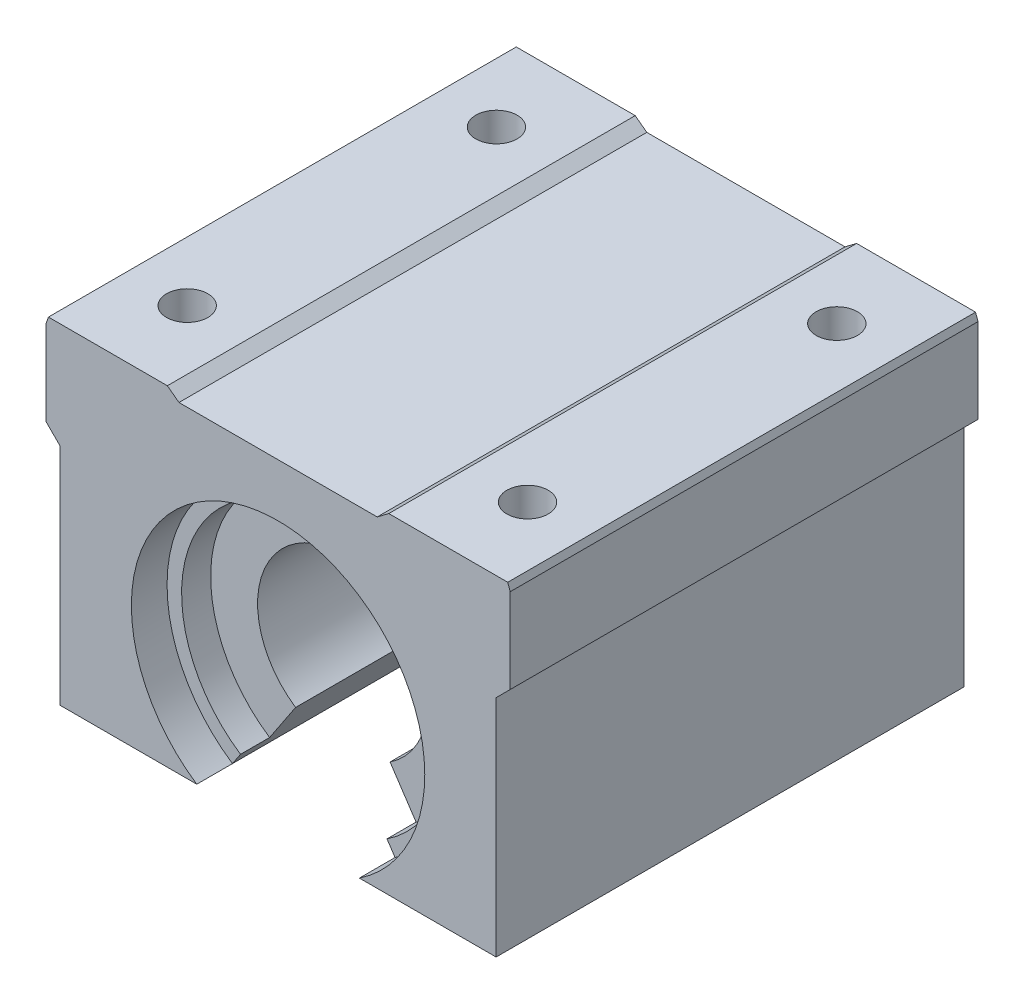
ISO-10303-21;
HEADER;
FILE_DESCRIPTION(('STEP AP214'),'2;1');
FILE_NAME('part.step','',(''),(''),'','','');
FILE_SCHEMA(('AUTOMOTIVE_DESIGN { 1 0 10303 214 1 1 1 1 }'));
ENDSEC;
DATA;
#1=APPLICATION_CONTEXT('core data for automotive mechanical design processes');
#2=APPLICATION_PROTOCOL_DEFINITION('international standard','automotive_design',2000,#1);
#3=PRODUCT_CONTEXT('',#1,'mechanical');
#4=PRODUCT('Part','Part','',(#3));
#5=PRODUCT_RELATED_PRODUCT_CATEGORY('part','',(#4));
#6=PRODUCT_DEFINITION_FORMATION('','',#4);
#7=PRODUCT_DEFINITION_CONTEXT('part definition',#1,'design');
#8=PRODUCT_DEFINITION('design','',#6,#7);
#9=PRODUCT_DEFINITION_SHAPE('','',#8);
#10=(LENGTH_UNIT() NAMED_UNIT(*) SI_UNIT(.MILLI.,.METRE.));
#11=(NAMED_UNIT(*) PLANE_ANGLE_UNIT() SI_UNIT($,.RADIAN.));
#12=(NAMED_UNIT(*) SI_UNIT($,.STERADIAN.) SOLID_ANGLE_UNIT());
#13=UNCERTAINTY_MEASURE_WITH_UNIT(LENGTH_MEASURE(1.E-05),#10,'distance_accuracy_value','');
#14=(GEOMETRIC_REPRESENTATION_CONTEXT(3) GLOBAL_UNCERTAINTY_ASSIGNED_CONTEXT((#13)) GLOBAL_UNIT_ASSIGNED_CONTEXT((#10,
#11,#12)) REPRESENTATION_CONTEXT('',''));
#15=CARTESIAN_POINT('',(0.,0.,0.));
#16=DIRECTION('',(0.,0.,1.));
#17=DIRECTION('',(1.,0.,0.));
#18=AXIS2_PLACEMENT_3D('',#15,#16,#17);
#19=CARTESIAN_POINT('',(0.,-3.72110000000001,19.05));
#20=DIRECTION('',(0.,0.,-1.));
#21=DIRECTION('',(-1.,0.,0.));
#22=AXIS2_PLACEMENT_3D('',#19,#20,#21);
#23=CYLINDRICAL_SURFACE('',#22,12.7);
#24=CARTESIAN_POINT('',(0.,-3.72110000000001,-16.256));
#25=DIRECTION('',(0.,0.,1.));
#26=DIRECTION('',(1.,0.,0.));
#27=AXIS2_PLACEMENT_3D('',#24,#25,#26);
#28=CIRCLE('',#27,12.7);
#29=CARTESIAN_POINT('',(7.03740732273973,-14.2929918918919,-16.256));
#30=VERTEX_POINT('',#29);
#31=CARTESIAN_POINT('',(-7.03740732273972,-14.2929918918919,-16.256));
#32=VERTEX_POINT('',#31);
#33=EDGE_CURVE('E51',#30,#32,#28,.T.);
#34=ORIENTED_EDGE('',*,*,#33,.T.);
#35=DIRECTION('',(0.,0.,-1.));
#36=VECTOR('',#35,1.);
#37=CARTESIAN_POINT('',(-7.03740732273972,-14.2929918918919,19.05));
#38=LINE('',#37,#36);
#39=CARTESIAN_POINT('',(-7.03740732273972,-14.2929918918919,-19.05));
#40=VERTEX_POINT('',#39);
#41=EDGE_CURVE('E225',#32,#40,#38,.T.);
#42=ORIENTED_EDGE('',*,*,#41,.T.);
#43=CARTESIAN_POINT('',(0.,-3.72110000000001,-19.05));
#44=DIRECTION('',(0.,0.,-1.));
#45=DIRECTION('',(1.,0.,0.));
#46=AXIS2_PLACEMENT_3D('',#43,#44,#45);
#47=CIRCLE('',#46,12.7);
#48=CARTESIAN_POINT('',(7.03740732273973,-14.2929918918919,-19.05));
#49=VERTEX_POINT('',#48);
#50=EDGE_CURVE('E443',#40,#49,#47,.T.);
#51=ORIENTED_EDGE('',*,*,#50,.T.);
#52=DIRECTION('',(0.,0.,-1.));
#53=VECTOR('',#52,1.);
#54=CARTESIAN_POINT('',(7.03740732273973,-14.2929918918919,19.05));
#55=LINE('',#54,#53);
#56=EDGE_CURVE('E464',#30,#49,#55,.T.);
#57=ORIENTED_EDGE('',*,*,#56,.F.);
#58=EDGE_LOOP('',(#34,#42,#51,#57));
#59=FACE_BOUND('',#58,.T.);
#60=ADVANCED_FACE('F36',(#59),#23,.F.);
#61=CARTESIAN_POINT('',(0.,-3.72110000000001,-22.479));
#62=DIRECTION('',(0.,0.,1.));
#63=DIRECTION('',(1.,0.,0.));
#64=AXIS2_PLACEMENT_3D('',#61,#62,#63);
#65=CYLINDRICAL_SURFACE('',#64,14.097);
#66=CARTESIAN_POINT('',(0.,-3.72110000000001,-19.05));
#67=DIRECTION('',(0.,0.,1.));
#68=DIRECTION('',(1.,0.,0.));
#69=AXIS2_PLACEMENT_3D('',#66,#67,#68);
#70=CIRCLE('',#69,14.097);
#71=CARTESIAN_POINT('',(7.8115221282411,-15.4559,-19.05));
#72=VERTEX_POINT('',#71);
#73=CARTESIAN_POINT('',(-7.81152212824109,-15.4559,-19.05));
#74=VERTEX_POINT('',#73);
#75=EDGE_CURVE('E433',#72,#74,#70,.T.);
#76=ORIENTED_EDGE('',*,*,#75,.T.);
#77=DIRECTION('',(0.,0.,1.));
#78=VECTOR('',#77,1.);
#79=CARTESIAN_POINT('',(-7.81152212824109,-15.4559,-22.479));
#80=LINE('',#79,#78);
#81=CARTESIAN_POINT('',(-7.8115221282411,-15.4559,-22.479));
#82=VERTEX_POINT('',#81);
#83=EDGE_CURVE('E239',#82,#74,#80,.T.);
#84=ORIENTED_EDGE('',*,*,#83,.F.);
#85=CARTESIAN_POINT('',(0.,-3.72110000000001,-22.479));
#86=DIRECTION('',(0.,0.,1.));
#87=DIRECTION('',(1.,0.,0.));
#88=AXIS2_PLACEMENT_3D('',#85,#86,#87);
#89=CIRCLE('',#88,14.097);
#90=CARTESIAN_POINT('',(7.8115221282411,-15.4559,-22.479));
#91=VERTEX_POINT('',#90);
#92=EDGE_CURVE('E11',#91,#82,#89,.T.);
#93=ORIENTED_EDGE('',*,*,#92,.F.);
#94=DIRECTION('',(0.,0.,1.));
#95=VECTOR('',#94,1.);
#96=CARTESIAN_POINT('',(7.81152212824109,-15.4559,-22.479));
#97=LINE('',#96,#95);
#98=EDGE_CURVE('E235',#72,#91,#97,.F.);
#99=ORIENTED_EDGE('',*,*,#98,.F.);
#100=EDGE_LOOP('',(#76,#84,#93,#99));
#101=FACE_BOUND('',#100,.T.);
#102=ADVANCED_FACE('F431',(#101),#65,.F.);
#103=CARTESIAN_POINT('',(-20.955,-15.4559,22.479));
#104=DIRECTION('',(0.,1.,0.));
#105=DIRECTION('',(0.,0.,1.));
#106=AXIS2_PLACEMENT_3D('',#103,#104,#105);
#107=PLANE('',#106);
#108=CARTESIAN_POINT('',(-16.3533929802272,-15.4559,14.859));
#109=DIRECTION('',(0.,1.,0.));
#110=DIRECTION('',(0.,0.,1.));
#111=AXIS2_PLACEMENT_3D('',#108,#109,#110);
#112=CIRCLE('',#111,1.98437499999999);
#113=CARTESIAN_POINT('',(-16.3533929802272,-15.4559,16.843375));
#114=VERTEX_POINT('',#113);
#115=EDGE_CURVE('E251',#114,#114,#112,.T.);
#116=ORIENTED_EDGE('',*,*,#115,.T.);
#117=EDGE_LOOP('',(#116));
#118=FACE_BOUND('',#117,.T.);
#119=CARTESIAN_POINT('',(-16.3533929802272,-15.4559,-14.859));
#120=DIRECTION('',(0.,1.,0.));
#121=DIRECTION('',(0.,0.,1.));
#122=AXIS2_PLACEMENT_3D('',#119,#120,#121);
#123=CIRCLE('',#122,1.98437499999999);
#124=CARTESIAN_POINT('',(-16.3533929802272,-15.4559,-12.874625));
#125=VERTEX_POINT('',#124);
#126=EDGE_CURVE('E245',#125,#125,#123,.T.);
#127=ORIENTED_EDGE('',*,*,#126,.T.);
#128=EDGE_LOOP('',(#127));
#129=FACE_BOUND('',#128,.T.);
#130=DIRECTION('',(1.,0.,0.));
#131=VECTOR('',#130,1.);
#132=CARTESIAN_POINT('',(-20.955,-15.4559,-22.479));
#133=LINE('',#132,#131);
#134=CARTESIAN_POINT('',(-20.955,-15.4559,-22.479));
#135=VERTEX_POINT('',#134);
#136=EDGE_CURVE('E317',#135,#82,#133,.T.);
#137=ORIENTED_EDGE('',*,*,#136,.T.);
#138=ORIENTED_EDGE('',*,*,#83,.T.);
#139=DIRECTION('',(0.,0.,-1.));
#140=VECTOR('',#139,1.);
#141=CARTESIAN_POINT('',(-7.8115221282411,-15.4559,19.05));
#142=LINE('',#141,#140);
#143=CARTESIAN_POINT('',(-7.81152212824109,-15.4559,19.05));
#144=VERTEX_POINT('',#143);
#145=EDGE_CURVE('E224',#144,#74,#142,.T.);
#146=ORIENTED_EDGE('',*,*,#145,.F.);
#147=CARTESIAN_POINT('',(-7.8115221282411,-15.4559,22.479));
#148=VERTEX_POINT('',#147);
#149=EDGE_CURVE('E59',#144,#148,#80,.T.);
#150=ORIENTED_EDGE('',*,*,#149,.T.);
#151=DIRECTION('',(1.,0.,0.));
#152=VECTOR('',#151,1.);
#153=CARTESIAN_POINT('',(-20.955,-15.4559,22.479));
#154=LINE('',#153,#152);
#155=CARTESIAN_POINT('',(-20.955,-15.4559,22.479));
#156=VERTEX_POINT('',#155);
#157=EDGE_CURVE('E286',#156,#148,#154,.T.);
#158=ORIENTED_EDGE('',*,*,#157,.F.);
#159=DIRECTION('',(0.,0.,-1.));
#160=VECTOR('',#159,1.);
#161=CARTESIAN_POINT('',(-20.955,-15.4559,22.479));
#162=LINE('',#161,#160);
#163=EDGE_CURVE('E346',#156,#135,#162,.T.);
#164=ORIENTED_EDGE('',*,*,#163,.T.);
#165=EDGE_LOOP('',(#137,#138,#146,#150,#158,#164));
#166=FACE_BOUND('',#165,.T.);
#167=ADVANCED_FACE('F436',(#118,#129,#166),#107,.F.);
#168=CARTESIAN_POINT('',(-10.6383929802272,16.2941,22.479));
#169=DIRECTION('',(0.,-1.,0.));
#170=DIRECTION('',(1.,0.,0.));
#171=AXIS2_PLACEMENT_3D('',#168,#169,#170);
#172=PLANE('',#171);
#173=DIRECTION('',(-1.,0.,0.));
#174=VECTOR('',#173,1.);
#175=CARTESIAN_POINT('',(-10.6383929802272,16.2941,-22.479));
#176=LINE('',#175,#174);
#177=CARTESIAN_POINT('',(-10.6383929802272,16.2941,-22.479));
#178=VERTEX_POINT('',#177);
#179=CARTESIAN_POINT('',(-22.0683929802272,16.2941,-22.479));
#180=VERTEX_POINT('',#179);
#181=EDGE_CURVE('E306',#178,#180,#176,.T.);
#182=ORIENTED_EDGE('',*,*,#181,.T.);
#183=DIRECTION('',(0.,0.,-1.));
#184=VECTOR('',#183,1.);
#185=CARTESIAN_POINT('',(-22.0683929802272,16.2941,22.479));
#186=LINE('',#185,#184);
#187=CARTESIAN_POINT('',(-22.0683929802272,16.2941,22.479));
#188=VERTEX_POINT('',#187);
#189=EDGE_CURVE('E358',#188,#180,#186,.T.);
#190=ORIENTED_EDGE('',*,*,#189,.F.);
#191=DIRECTION('',(-1.,0.,0.));
#192=VECTOR('',#191,1.);
#193=CARTESIAN_POINT('',(-10.6383929802272,16.2941,22.479));
#194=LINE('',#193,#192);
#195=CARTESIAN_POINT('',(-10.6383929802272,16.2941,22.479));
#196=VERTEX_POINT('',#195);
#197=EDGE_CURVE('E275',#196,#188,#194,.T.);
#198=ORIENTED_EDGE('',*,*,#197,.F.);
#199=DIRECTION('',(0.,0.,-1.));
#200=VECTOR('',#199,1.);
#201=CARTESIAN_POINT('',(-10.6383929802272,16.2941,22.479));
#202=LINE('',#201,#200);
#203=EDGE_CURVE('E361',#196,#178,#202,.T.);
#204=ORIENTED_EDGE('',*,*,#203,.T.);
#205=EDGE_LOOP('',(#182,#190,#198,#204));
#206=FACE_BOUND('',#205,.T.);
#207=CARTESIAN_POINT('',(-16.3533929802272,16.2941,14.859));
#208=DIRECTION('',(0.,1.,0.));
#209=DIRECTION('',(0.,0.,1.));
#210=AXIS2_PLACEMENT_3D('',#207,#208,#209);
#211=CIRCLE('',#210,1.984375);
#212=CARTESIAN_POINT('',(-16.3533929802272,16.2941,16.843375));
#213=VERTEX_POINT('',#212);
#214=EDGE_CURVE('E248',#213,#213,#211,.T.);
#215=ORIENTED_EDGE('',*,*,#214,.F.);
#216=EDGE_LOOP('',(#215));
#217=FACE_BOUND('',#216,.T.);
#218=CARTESIAN_POINT('',(-16.3533929802272,16.2941,-14.859));
#219=DIRECTION('',(0.,1.,0.));
#220=DIRECTION('',(0.,0.,1.));
#221=AXIS2_PLACEMENT_3D('',#218,#219,#220);
#222=CIRCLE('',#221,1.984375);
#223=CARTESIAN_POINT('',(-16.3533929802272,16.2941,-12.874625));
#224=VERTEX_POINT('',#223);
#225=EDGE_CURVE('E242',#224,#224,#222,.T.);
#226=ORIENTED_EDGE('',*,*,#225,.F.);
#227=EDGE_LOOP('',(#226));
#228=FACE_BOUND('',#227,.T.);
#229=ADVANCED_FACE('F389',(#206,#217,#228),#172,.F.);
#230=CARTESIAN_POINT('',(22.0683929802272,16.2941,22.479));
#231=DIRECTION('',(0.,-1.,0.));
#232=DIRECTION('',(1.,0.,0.));
#233=AXIS2_PLACEMENT_3D('',#230,#231,#232);
#234=PLANE('',#233);
#235=CARTESIAN_POINT('',(16.3533929802273,16.2941,14.859));
#236=DIRECTION('',(0.,1.,0.));
#237=DIRECTION('',(0.,0.,1.));
#238=AXIS2_PLACEMENT_3D('',#235,#236,#237);
#239=CIRCLE('',#238,1.984375);
#240=CARTESIAN_POINT('',(16.3533929802273,16.2941,16.843375));
#241=VERTEX_POINT('',#240);
#242=EDGE_CURVE('E254',#241,#241,#239,.T.);
#243=ORIENTED_EDGE('',*,*,#242,.F.);
#244=EDGE_LOOP('',(#243));
#245=FACE_BOUND('',#244,.T.);
#246=DIRECTION('',(-1.,0.,0.));
#247=VECTOR('',#246,1.);
#248=CARTESIAN_POINT('',(22.0683929802272,16.2941,-22.479));
#249=LINE('',#248,#247);
#250=CARTESIAN_POINT('',(22.0683929802272,16.2941,-22.479));
#251=VERTEX_POINT('',#250);
#252=CARTESIAN_POINT('',(10.6383929802272,16.2941,-22.479));
#253=VERTEX_POINT('',#252);
#254=EDGE_CURVE('E271',#251,#253,#249,.T.);
#255=ORIENTED_EDGE('',*,*,#254,.T.);
#256=DIRECTION('',(0.,0.,-1.));
#257=VECTOR('',#256,1.);
#258=CARTESIAN_POINT('',(10.6383929802272,16.2941,22.479));
#259=LINE('',#258,#257);
#260=CARTESIAN_POINT('',(10.6383929802272,16.2941,22.479));
#261=VERTEX_POINT('',#260);
#262=EDGE_CURVE('E299',#261,#253,#259,.T.);
#263=ORIENTED_EDGE('',*,*,#262,.F.);
#264=DIRECTION('',(-1.,0.,0.));
#265=VECTOR('',#264,1.);
#266=CARTESIAN_POINT('',(22.0683929802272,16.2941,22.479));
#267=LINE('',#266,#265);
#268=CARTESIAN_POINT('',(22.0683929802272,16.2941,22.479));
#269=VERTEX_POINT('',#268);
#270=EDGE_CURVE('E297',#269,#261,#267,.T.);
#271=ORIENTED_EDGE('',*,*,#270,.F.);
#272=DIRECTION('',(0.,0.,-1.));
#273=VECTOR('',#272,1.);
#274=CARTESIAN_POINT('',(22.0683929802272,16.2941,22.479));
#275=LINE('',#274,#273);
#276=EDGE_CURVE('E331',#269,#251,#275,.T.);
#277=ORIENTED_EDGE('',*,*,#276,.T.);
#278=EDGE_LOOP('',(#255,#263,#271,#277));
#279=FACE_BOUND('',#278,.T.);
#280=CARTESIAN_POINT('',(16.3533929802272,16.2941,-14.859));
#281=DIRECTION('',(0.,1.,0.));
#282=DIRECTION('',(0.,0.,1.));
#283=AXIS2_PLACEMENT_3D('',#280,#281,#282);
#284=CIRCLE('',#283,1.984375);
#285=CARTESIAN_POINT('',(16.3533929802272,16.2941,-12.874625));
#286=VERTEX_POINT('',#285);
#287=EDGE_CURVE('E260',#286,#286,#284,.T.);
#288=ORIENTED_EDGE('',*,*,#287,.F.);
#289=EDGE_LOOP('',(#288));
#290=FACE_BOUND('',#289,.T.);
#291=ADVANCED_FACE('F401',(#245,#279,#290),#234,.F.);
#292=CARTESIAN_POINT('',(10.6383929802272,16.2941,22.479));
#293=DIRECTION('',(0.601448008613873,-0.798911943166709,0.));
#294=DIRECTION('',(0.798911943166709,0.601448008613873,0.));
#295=AXIS2_PLACEMENT_3D('',#292,#293,#294);
#296=PLANE('',#295);
#297=DIRECTION('',(-0.798911943166709,-0.601448008613873,0.));
#298=VECTOR('',#297,1.);
#299=CARTESIAN_POINT('',(10.6383929802272,16.2941,-22.479));
#300=LINE('',#299,#298);
#301=CARTESIAN_POINT('',(9.525,15.4559,-22.479));
#302=VERTEX_POINT('',#301);
#303=EDGE_CURVE('E266',#253,#302,#300,.T.);
#304=ORIENTED_EDGE('',*,*,#303,.T.);
#305=DIRECTION('',(0.,0.,-1.));
#306=VECTOR('',#305,1.);
#307=CARTESIAN_POINT('',(9.525,15.4559,22.479));
#308=LINE('',#307,#306);
#309=CARTESIAN_POINT('',(9.525,15.4559,22.479));
#310=VERTEX_POINT('',#309);
#311=EDGE_CURVE('E44',#310,#302,#308,.T.);
#312=ORIENTED_EDGE('',*,*,#311,.F.);
#313=DIRECTION('',(-0.798911943166709,-0.601448008613873,0.));
#314=VECTOR('',#313,1.);
#315=CARTESIAN_POINT('',(10.6383929802272,16.2941,22.479));
#316=LINE('',#315,#314);
#317=EDGE_CURVE('E267',#261,#310,#316,.T.);
#318=ORIENTED_EDGE('',*,*,#317,.F.);
#319=ORIENTED_EDGE('',*,*,#262,.T.);
#320=EDGE_LOOP('',(#304,#312,#318,#319));
#321=FACE_BOUND('',#320,.T.);
#322=ADVANCED_FACE('F38',(#321),#296,.F.);
#323=CARTESIAN_POINT('',(9.525,15.4559,22.479));
#324=DIRECTION('',(0.,-1.,0.));
#325=DIRECTION('',(0.,0.,-1.));
#326=AXIS2_PLACEMENT_3D('',#323,#324,#325);
#327=PLANE('',#326);
#328=DIRECTION('',(-1.,0.,0.));
#329=VECTOR('',#328,1.);
#330=CARTESIAN_POINT('',(9.525,15.4559,-22.479));
#331=LINE('',#330,#329);
#332=CARTESIAN_POINT('',(-9.525,15.4559,-22.479));
#333=VERTEX_POINT('',#332);
#334=EDGE_CURVE('E302',#302,#333,#331,.T.);
#335=ORIENTED_EDGE('',*,*,#334,.T.);
#336=DIRECTION('',(0.,0.,-1.));
#337=VECTOR('',#336,1.);
#338=CARTESIAN_POINT('',(-9.525,15.4559,22.479));
#339=LINE('',#338,#337);
#340=CARTESIAN_POINT('',(-9.525,15.4559,22.479));
#341=VERTEX_POINT('',#340);
#342=EDGE_CURVE('E364',#341,#333,#339,.T.);
#343=ORIENTED_EDGE('',*,*,#342,.F.);
#344=DIRECTION('',(-1.,0.,0.));
#345=VECTOR('',#344,1.);
#346=CARTESIAN_POINT('',(9.525,15.4559,22.479));
#347=LINE('',#346,#345);
#348=EDGE_CURVE('E270',#310,#341,#347,.T.);
#349=ORIENTED_EDGE('',*,*,#348,.F.);
#350=ORIENTED_EDGE('',*,*,#311,.T.);
#351=EDGE_LOOP('',(#335,#343,#349,#350));
#352=FACE_BOUND('',#351,.T.);
#353=ADVANCED_FACE('F369',(#352),#327,.F.);
#354=CARTESIAN_POINT('',(-9.525,15.4559,22.479));
#355=DIRECTION('',(-0.601448008613873,-0.798911943166709,0.));
#356=DIRECTION('',(0.798911943166709,-0.601448008613873,0.));
#357=AXIS2_PLACEMENT_3D('',#354,#355,#356);
#358=PLANE('',#357);
#359=DIRECTION('',(-0.798911943166709,0.601448008613873,0.));
#360=VECTOR('',#359,1.);
#361=CARTESIAN_POINT('',(-9.525,15.4559,-22.479));
#362=LINE('',#361,#360);
#363=EDGE_CURVE('E304',#333,#178,#362,.T.);
#364=ORIENTED_EDGE('',*,*,#363,.T.);
#365=ORIENTED_EDGE('',*,*,#203,.F.);
#366=DIRECTION('',(-0.798911943166709,0.601448008613873,0.));
#367=VECTOR('',#366,1.);
#368=CARTESIAN_POINT('',(-9.525,15.4559,22.479));
#369=LINE('',#368,#367);
#370=EDGE_CURVE('E273',#341,#196,#369,.T.);
#371=ORIENTED_EDGE('',*,*,#370,.F.);
#372=ORIENTED_EDGE('',*,*,#342,.T.);
#373=EDGE_LOOP('',(#364,#365,#371,#372));
#374=FACE_BOUND('',#373,.T.);
#375=ADVANCED_FACE('F385',(#374),#358,.F.);
#376=CARTESIAN_POINT('',(-22.3012,15.6191799227722,22.479));
#377=DIRECTION('',(0.945340188352479,-0.326085768296777,0.));
#378=DIRECTION('',(0.326085768296777,0.945340188352479,0.));
#379=AXIS2_PLACEMENT_3D('',#376,#377,#378);
#380=PLANE('',#379);
#381=DIRECTION('',(-0.326085768296777,-0.945340188352479,0.));
#382=VECTOR('',#381,1.);
#383=CARTESIAN_POINT('',(-22.3012,15.6191799227722,-22.479));
#384=LINE('',#383,#382);
#385=CARTESIAN_POINT('',(-22.3012,15.6191799227722,-22.479));
#386=VERTEX_POINT('',#385);
#387=EDGE_CURVE('E308',#180,#386,#384,.T.);
#388=ORIENTED_EDGE('',*,*,#387,.T.);
#389=DIRECTION('',(0.,0.,-1.));
#390=VECTOR('',#389,1.);
#391=CARTESIAN_POINT('',(-22.3012,15.6191799227722,22.479));
#392=LINE('',#391,#390);
#393=CARTESIAN_POINT('',(-22.3012,15.6191799227722,22.479));
#394=VERTEX_POINT('',#393);
#395=EDGE_CURVE('E355',#394,#386,#392,.T.);
#396=ORIENTED_EDGE('',*,*,#395,.F.);
#397=DIRECTION('',(-0.326085768296777,-0.945340188352479,0.));
#398=VECTOR('',#397,1.);
#399=CARTESIAN_POINT('',(-22.3012,15.6191799227722,22.479));
#400=LINE('',#399,#398);
#401=EDGE_CURVE('E277',#188,#394,#400,.T.);
#402=ORIENTED_EDGE('',*,*,#401,.F.);
#403=ORIENTED_EDGE('',*,*,#189,.T.);
#404=EDGE_LOOP('',(#388,#396,#402,#403));
#405=FACE_BOUND('',#404,.T.);
#406=ADVANCED_FACE('F554',(#405),#380,.F.);
#407=CARTESIAN_POINT('',(-22.3012,15.6191799227722,22.479));
#408=DIRECTION('',(1.,0.,0.));
#409=DIRECTION('',(0.,0.,-1.));
#410=AXIS2_PLACEMENT_3D('',#407,#408,#409);
#411=PLANE('',#410);
#412=DIRECTION('',(0.,-1.,0.));
#413=VECTOR('',#412,1.);
#414=CARTESIAN_POINT('',(-22.3012,15.6191799227722,-22.479));
#415=LINE('',#414,#413);
#416=CARTESIAN_POINT('',(-22.3012,7.4803,-22.479));
#417=VERTEX_POINT('',#416);
#418=EDGE_CURVE('E310',#386,#417,#415,.T.);
#419=ORIENTED_EDGE('',*,*,#418,.T.);
#420=DIRECTION('',(0.,0.,-1.));
#421=VECTOR('',#420,1.);
#422=CARTESIAN_POINT('',(-22.3012,7.4803,22.479));
#423=LINE('',#422,#421);
#424=CARTESIAN_POINT('',(-22.3012,7.4803,22.479));
#425=VERTEX_POINT('',#424);
#426=EDGE_CURVE('E352',#425,#417,#423,.T.);
#427=ORIENTED_EDGE('',*,*,#426,.F.);
#428=DIRECTION('',(0.,-1.,0.));
#429=VECTOR('',#428,1.);
#430=CARTESIAN_POINT('',(-22.3012,15.6191799227722,22.479));
#431=LINE('',#430,#429);
#432=EDGE_CURVE('E279',#394,#425,#431,.T.);
#433=ORIENTED_EDGE('',*,*,#432,.F.);
#434=ORIENTED_EDGE('',*,*,#395,.T.);
#435=EDGE_LOOP('',(#419,#427,#433,#434));
#436=FACE_BOUND('',#435,.T.);
#437=ADVANCED_FACE('F550',(#436),#411,.F.);
#438=CARTESIAN_POINT('',(-22.3012,7.4803,22.479));
#439=DIRECTION('',(0.707106781186547,0.707106781186548,0.));
#440=DIRECTION('',(-0.707106781186548,0.707106781186547,0.));
#441=AXIS2_PLACEMENT_3D('',#438,#439,#440);
#442=PLANE('',#441);
#443=DIRECTION('',(0.707106781186548,-0.707106781186547,0.));
#444=VECTOR('',#443,1.);
#445=CARTESIAN_POINT('',(-22.3012,7.4803,-22.479));
#446=LINE('',#445,#444);
#447=CARTESIAN_POINT('',(-20.955,6.1341,-22.479));
#448=VERTEX_POINT('',#447);
#449=EDGE_CURVE('E312',#417,#448,#446,.T.);
#450=ORIENTED_EDGE('',*,*,#449,.T.);
#451=DIRECTION('',(0.,0.,-1.));
#452=VECTOR('',#451,1.);
#453=CARTESIAN_POINT('',(-20.955,6.1341,22.479));
#454=LINE('',#453,#452);
#455=CARTESIAN_POINT('',(-20.955,6.1341,22.479));
#456=VERTEX_POINT('',#455);
#457=EDGE_CURVE('E349',#456,#448,#454,.T.);
#458=ORIENTED_EDGE('',*,*,#457,.F.);
#459=DIRECTION('',(0.707106781186548,-0.707106781186547,0.));
#460=VECTOR('',#459,1.);
#461=CARTESIAN_POINT('',(-22.3012,7.4803,22.479));
#462=LINE('',#461,#460);
#463=EDGE_CURVE('E281',#425,#456,#462,.T.);
#464=ORIENTED_EDGE('',*,*,#463,.F.);
#465=ORIENTED_EDGE('',*,*,#426,.T.);
#466=EDGE_LOOP('',(#450,#458,#464,#465));
#467=FACE_BOUND('',#466,.T.);
#468=ADVANCED_FACE('F546',(#467),#442,.F.);
#469=CARTESIAN_POINT('',(-20.955,6.1341,22.479));
#470=DIRECTION('',(1.,0.,0.));
#471=DIRECTION('',(0.,1.,0.));
#472=AXIS2_PLACEMENT_3D('',#469,#470,#471);
#473=PLANE('',#472);
#474=DIRECTION('',(0.,-1.,0.));
#475=VECTOR('',#474,1.);
#476=CARTESIAN_POINT('',(-20.955,6.1341,-22.479));
#477=LINE('',#476,#475);
#478=EDGE_CURVE('E314',#448,#135,#477,.T.);
#479=ORIENTED_EDGE('',*,*,#478,.T.);
#480=ORIENTED_EDGE('',*,*,#163,.F.);
#481=DIRECTION('',(0.,-1.,0.));
#482=VECTOR('',#481,1.);
#483=CARTESIAN_POINT('',(-20.955,6.1341,22.479));
#484=LINE('',#483,#482);
#485=EDGE_CURVE('E283',#456,#156,#484,.T.);
#486=ORIENTED_EDGE('',*,*,#485,.F.);
#487=ORIENTED_EDGE('',*,*,#457,.T.);
#488=EDGE_LOOP('',(#479,#480,#486,#487));
#489=FACE_BOUND('',#488,.T.);
#490=ADVANCED_FACE('F542',(#489),#473,.F.);
#491=CARTESIAN_POINT('',(16.3533929802273,-15.4559,14.859));
#492=DIRECTION('',(0.,1.,0.));
#493=DIRECTION('',(0.,0.,1.));
#494=AXIS2_PLACEMENT_3D('',#491,#492,#493);
#495=CIRCLE('',#494,1.98437499999999);
#496=CARTESIAN_POINT('',(16.3533929802273,-15.4559,16.843375));
#497=VERTEX_POINT('',#496);
#498=EDGE_CURVE('E257',#497,#497,#495,.T.);
#499=ORIENTED_EDGE('',*,*,#498,.T.);
#500=EDGE_LOOP('',(#499));
#501=FACE_BOUND('',#500,.T.);
#502=CARTESIAN_POINT('',(16.3533929802272,-15.4559,-14.859));
#503=DIRECTION('',(0.,1.,0.));
#504=DIRECTION('',(0.,0.,1.));
#505=AXIS2_PLACEMENT_3D('',#502,#503,#504);
#506=CIRCLE('',#505,1.98437499999999);
#507=CARTESIAN_POINT('',(16.3533929802272,-15.4559,-12.874625));
#508=VERTEX_POINT('',#507);
#509=EDGE_CURVE('E263',#508,#508,#506,.T.);
#510=ORIENTED_EDGE('',*,*,#509,.T.);
#511=EDGE_LOOP('',(#510));
#512=FACE_BOUND('',#511,.T.);
#513=CARTESIAN_POINT('',(7.8115221282411,-15.4559,22.479));
#514=VERTEX_POINT('',#513);
#515=CARTESIAN_POINT('',(20.955,-15.4559,22.479));
#516=VERTEX_POINT('',#515);
#517=EDGE_CURVE('E285',#514,#516,#154,.T.);
#518=ORIENTED_EDGE('',*,*,#517,.F.);
#519=CARTESIAN_POINT('',(7.81152212824109,-15.4559,19.05));
#520=VERTEX_POINT('',#519);
#521=EDGE_CURVE('E236',#514,#520,#97,.F.);
#522=ORIENTED_EDGE('',*,*,#521,.T.);
#523=DIRECTION('',(0.,0.,-1.));
#524=VECTOR('',#523,1.);
#525=CARTESIAN_POINT('',(7.8115221282411,-15.4559,19.05));
#526=LINE('',#525,#524);
#527=EDGE_CURVE('E428',#520,#72,#526,.T.);
#528=ORIENTED_EDGE('',*,*,#527,.T.);
#529=ORIENTED_EDGE('',*,*,#98,.T.);
#530=CARTESIAN_POINT('',(20.955,-15.4559,-22.479));
#531=VERTEX_POINT('',#530);
#532=EDGE_CURVE('E316',#91,#531,#133,.T.);
#533=ORIENTED_EDGE('',*,*,#532,.T.);
#534=DIRECTION('',(0.,0.,-1.));
#535=VECTOR('',#534,1.);
#536=CARTESIAN_POINT('',(20.955,-15.4559,22.479));
#537=LINE('',#536,#535);
#538=EDGE_CURVE('E343',#516,#531,#537,.T.);
#539=ORIENTED_EDGE('',*,*,#538,.F.);
#540=EDGE_LOOP('',(#518,#522,#528,#529,#533,#539));
#541=FACE_BOUND('',#540,.T.);
#542=ADVANCED_FACE('F425',(#501,#512,#541),#107,.F.);
#543=CARTESIAN_POINT('',(20.955,-15.4559,22.479));
#544=DIRECTION('',(-1.,0.,0.));
#545=DIRECTION('',(0.,-1.,0.));
#546=AXIS2_PLACEMENT_3D('',#543,#544,#545);
#547=PLANE('',#546);
#548=DIRECTION('',(0.,1.,0.));
#549=VECTOR('',#548,1.);
#550=CARTESIAN_POINT('',(20.955,-15.4559,-22.479));
#551=LINE('',#550,#549);
#552=CARTESIAN_POINT('',(20.955,6.1341,-22.479));
#553=VERTEX_POINT('',#552);
#554=EDGE_CURVE('E320',#531,#553,#551,.T.);
#555=ORIENTED_EDGE('',*,*,#554,.T.);
#556=DIRECTION('',(0.,0.,-1.));
#557=VECTOR('',#556,1.);
#558=CARTESIAN_POINT('',(20.955,6.1341,22.479));
#559=LINE('',#558,#557);
#560=CARTESIAN_POINT('',(20.955,6.1341,22.479));
#561=VERTEX_POINT('',#560);
#562=EDGE_CURVE('E340',#561,#553,#559,.T.);
#563=ORIENTED_EDGE('',*,*,#562,.F.);
#564=DIRECTION('',(0.,1.,0.));
#565=VECTOR('',#564,1.);
#566=CARTESIAN_POINT('',(20.955,-15.4559,22.479));
#567=LINE('',#566,#565);
#568=EDGE_CURVE('E289',#516,#561,#567,.T.);
#569=ORIENTED_EDGE('',*,*,#568,.F.);
#570=ORIENTED_EDGE('',*,*,#538,.T.);
#571=EDGE_LOOP('',(#555,#563,#569,#570));
#572=FACE_BOUND('',#571,.T.);
#573=ADVANCED_FACE('F419',(#572),#547,.F.);
#574=CARTESIAN_POINT('',(20.955,6.1341,22.479));
#575=DIRECTION('',(-0.707106781186547,0.707106781186548,0.));
#576=DIRECTION('',(-0.707106781186548,-0.707106781186547,0.));
#577=AXIS2_PLACEMENT_3D('',#574,#575,#576);
#578=PLANE('',#577);
#579=DIRECTION('',(0.707106781186548,0.707106781186547,0.));
#580=VECTOR('',#579,1.);
#581=CARTESIAN_POINT('',(20.955,6.1341,-22.479));
#582=LINE('',#581,#580);
#583=CARTESIAN_POINT('',(22.3012,7.4803,-22.479));
#584=VERTEX_POINT('',#583);
#585=EDGE_CURVE('E322',#553,#584,#582,.T.);
#586=ORIENTED_EDGE('',*,*,#585,.T.);
#587=DIRECTION('',(0.,0.,-1.));
#588=VECTOR('',#587,1.);
#589=CARTESIAN_POINT('',(22.3012,7.4803,22.479));
#590=LINE('',#589,#588);
#591=CARTESIAN_POINT('',(22.3012,7.4803,22.479));
#592=VERTEX_POINT('',#591);
#593=EDGE_CURVE('E337',#592,#584,#590,.T.);
#594=ORIENTED_EDGE('',*,*,#593,.F.);
#595=DIRECTION('',(0.707106781186548,0.707106781186547,0.));
#596=VECTOR('',#595,1.);
#597=CARTESIAN_POINT('',(20.955,6.1341,22.479));
#598=LINE('',#597,#596);
#599=EDGE_CURVE('E291',#561,#592,#598,.T.);
#600=ORIENTED_EDGE('',*,*,#599,.F.);
#601=ORIENTED_EDGE('',*,*,#562,.T.);
#602=EDGE_LOOP('',(#586,#594,#600,#601));
#603=FACE_BOUND('',#602,.T.);
#604=ADVANCED_FACE('F415',(#603),#578,.F.);
#605=CARTESIAN_POINT('',(22.3012,7.4803,22.479));
#606=DIRECTION('',(-1.,0.,0.));
#607=DIRECTION('',(0.,0.,1.));
#608=AXIS2_PLACEMENT_3D('',#605,#606,#607);
#609=PLANE('',#608);
#610=DIRECTION('',(0.,1.,0.));
#611=VECTOR('',#610,1.);
#612=CARTESIAN_POINT('',(22.3012,7.4803,-22.479));
#613=LINE('',#612,#611);
#614=CARTESIAN_POINT('',(22.3012,15.6191799227722,-22.479));
#615=VERTEX_POINT('',#614);
#616=EDGE_CURVE('E324',#584,#615,#613,.T.);
#617=ORIENTED_EDGE('',*,*,#616,.T.);
#618=DIRECTION('',(0.,0.,-1.));
#619=VECTOR('',#618,1.);
#620=CARTESIAN_POINT('',(22.3012,15.6191799227722,22.479));
#621=LINE('',#620,#619);
#622=CARTESIAN_POINT('',(22.3012,15.6191799227722,22.479));
#623=VERTEX_POINT('',#622);
#624=EDGE_CURVE('E334',#623,#615,#621,.T.);
#625=ORIENTED_EDGE('',*,*,#624,.F.);
#626=DIRECTION('',(0.,1.,0.));
#627=VECTOR('',#626,1.);
#628=CARTESIAN_POINT('',(22.3012,7.4803,22.479));
#629=LINE('',#628,#627);
#630=EDGE_CURVE('E293',#592,#623,#629,.T.);
#631=ORIENTED_EDGE('',*,*,#630,.F.);
#632=ORIENTED_EDGE('',*,*,#593,.T.);
#633=EDGE_LOOP('',(#617,#625,#631,#632));
#634=FACE_BOUND('',#633,.T.);
#635=ADVANCED_FACE('F410',(#634),#609,.F.);
#636=CARTESIAN_POINT('',(22.0683929802272,16.2941,22.479));
#637=DIRECTION('',(-0.945340188352479,-0.326085768296777,0.));
#638=DIRECTION('',(0.326085768296777,-0.945340188352479,0.));
#639=AXIS2_PLACEMENT_3D('',#636,#637,#638);
#640=PLANE('',#639);
#641=DIRECTION('',(-0.326085768296777,0.945340188352479,0.));
#642=VECTOR('',#641,1.);
#643=CARTESIAN_POINT('',(22.0683929802272,16.2941,-22.479));
#644=LINE('',#643,#642);
#645=EDGE_CURVE('E326',#615,#251,#644,.T.);
#646=ORIENTED_EDGE('',*,*,#645,.T.);
#647=ORIENTED_EDGE('',*,*,#276,.F.);
#648=DIRECTION('',(-0.326085768296777,0.945340188352479,0.));
#649=VECTOR('',#648,1.);
#650=CARTESIAN_POINT('',(22.0683929802272,16.2941,22.479));
#651=LINE('',#650,#649);
#652=EDGE_CURVE('E295',#623,#269,#651,.T.);
#653=ORIENTED_EDGE('',*,*,#652,.F.);
#654=ORIENTED_EDGE('',*,*,#624,.T.);
#655=EDGE_LOOP('',(#646,#647,#653,#654));
#656=FACE_BOUND('',#655,.T.);
#657=ADVANCED_FACE('F404',(#656),#640,.F.);
#658=CARTESIAN_POINT('',(0.,0.,22.479));
#659=DIRECTION('',(0.,0.,1.));
#660=DIRECTION('',(1.,0.,0.));
#661=AXIS2_PLACEMENT_3D('',#658,#659,#660);
#662=PLANE('',#661);
#663=CARTESIAN_POINT('',(0.,-3.72110000000001,22.479));
#664=DIRECTION('',(0.,0.,1.));
#665=DIRECTION('',(1.,0.,0.));
#666=AXIS2_PLACEMENT_3D('',#663,#664,#665);
#667=CIRCLE('',#666,14.097);
#668=EDGE_CURVE('E228',#514,#148,#667,.T.);
#669=ORIENTED_EDGE('',*,*,#668,.F.);
#670=ORIENTED_EDGE('',*,*,#517,.T.);
#671=ORIENTED_EDGE('',*,*,#568,.T.);
#672=ORIENTED_EDGE('',*,*,#599,.T.);
#673=ORIENTED_EDGE('',*,*,#630,.T.);
#674=ORIENTED_EDGE('',*,*,#652,.T.);
#675=ORIENTED_EDGE('',*,*,#270,.T.);
#676=ORIENTED_EDGE('',*,*,#317,.T.);
#677=ORIENTED_EDGE('',*,*,#348,.T.);
#678=ORIENTED_EDGE('',*,*,#370,.T.);
#679=ORIENTED_EDGE('',*,*,#197,.T.);
#680=ORIENTED_EDGE('',*,*,#401,.T.);
#681=ORIENTED_EDGE('',*,*,#432,.T.);
#682=ORIENTED_EDGE('',*,*,#463,.T.);
#683=ORIENTED_EDGE('',*,*,#485,.T.);
#684=ORIENTED_EDGE('',*,*,#157,.T.);
#685=EDGE_LOOP('',(#669,#670,#671,#672,#673,#674,#675,#676,#677,#678,#679,#680,#681,#682,#683,#684));
#686=FACE_BOUND('',#685,.T.);
#687=ADVANCED_FACE('F395',(#686),#662,.T.);
#688=CARTESIAN_POINT('',(0.,0.,-22.479));
#689=DIRECTION('',(0.,0.,1.));
#690=DIRECTION('',(1.,0.,0.));
#691=AXIS2_PLACEMENT_3D('',#688,#689,#690);
#692=PLANE('',#691);
#693=ORIENTED_EDGE('',*,*,#532,.F.);
#694=ORIENTED_EDGE('',*,*,#92,.T.);
#695=ORIENTED_EDGE('',*,*,#136,.F.);
#696=ORIENTED_EDGE('',*,*,#478,.F.);
#697=ORIENTED_EDGE('',*,*,#449,.F.);
#698=ORIENTED_EDGE('',*,*,#418,.F.);
#699=ORIENTED_EDGE('',*,*,#387,.F.);
#700=ORIENTED_EDGE('',*,*,#181,.F.);
#701=ORIENTED_EDGE('',*,*,#363,.F.);
#702=ORIENTED_EDGE('',*,*,#334,.F.);
#703=ORIENTED_EDGE('',*,*,#303,.F.);
#704=ORIENTED_EDGE('',*,*,#254,.F.);
#705=ORIENTED_EDGE('',*,*,#645,.F.);
#706=ORIENTED_EDGE('',*,*,#616,.F.);
#707=ORIENTED_EDGE('',*,*,#585,.F.);
#708=ORIENTED_EDGE('',*,*,#554,.F.);
#709=EDGE_LOOP('',(#693,#694,#695,#696,#697,#698,#699,#700,#701,#702,#703,#704,#705,#706,#707,#708));
#710=FACE_BOUND('',#709,.T.);
#711=ADVANCED_FACE('F378',(#710),#692,.F.);
#712=CARTESIAN_POINT('',(16.3533929802272,16.2941,-14.859));
#713=DIRECTION('',(0.,1.,0.));
#714=DIRECTION('',(0.,0.,1.));
#715=AXIS2_PLACEMENT_3D('',#712,#713,#714);
#716=CYLINDRICAL_SURFACE('',#715,1.98437499999999);
#717=ORIENTED_EDGE('',*,*,#509,.F.);
#718=EDGE_LOOP('',(#717));
#719=FACE_BOUND('',#718,.T.);
#720=ORIENTED_EDGE('',*,*,#287,.T.);
#721=EDGE_LOOP('',(#720));
#722=FACE_BOUND('',#721,.T.);
#723=ADVANCED_FACE('F520',(#719,#722),#716,.F.);
#724=CARTESIAN_POINT('',(16.3533929802273,16.2941,14.859));
#725=DIRECTION('',(0.,1.,0.));
#726=DIRECTION('',(0.,0.,1.));
#727=AXIS2_PLACEMENT_3D('',#724,#725,#726);
#728=CYLINDRICAL_SURFACE('',#727,1.98437499999999);
#729=ORIENTED_EDGE('',*,*,#498,.F.);
#730=EDGE_LOOP('',(#729));
#731=FACE_BOUND('',#730,.T.);
#732=ORIENTED_EDGE('',*,*,#242,.T.);
#733=EDGE_LOOP('',(#732));
#734=FACE_BOUND('',#733,.T.);
#735=ADVANCED_FACE('F516',(#731,#734),#728,.F.);
#736=CARTESIAN_POINT('',(-16.3533929802272,16.2941,14.859));
#737=DIRECTION('',(0.,1.,0.));
#738=DIRECTION('',(0.,0.,1.));
#739=AXIS2_PLACEMENT_3D('',#736,#737,#738);
#740=CYLINDRICAL_SURFACE('',#739,1.98437499999999);
#741=ORIENTED_EDGE('',*,*,#115,.F.);
#742=EDGE_LOOP('',(#741));
#743=FACE_BOUND('',#742,.T.);
#744=ORIENTED_EDGE('',*,*,#214,.T.);
#745=EDGE_LOOP('',(#744));
#746=FACE_BOUND('',#745,.T.);
#747=ADVANCED_FACE('F512',(#743,#746),#740,.F.);
#748=CARTESIAN_POINT('',(-16.3533929802272,16.2941,-14.859));
#749=DIRECTION('',(0.,1.,0.));
#750=DIRECTION('',(0.,0.,1.));
#751=AXIS2_PLACEMENT_3D('',#748,#749,#750);
#752=CYLINDRICAL_SURFACE('',#751,1.98437499999999);
#753=ORIENTED_EDGE('',*,*,#126,.F.);
#754=EDGE_LOOP('',(#753));
#755=FACE_BOUND('',#754,.T.);
#756=ORIENTED_EDGE('',*,*,#225,.T.);
#757=EDGE_LOOP('',(#756));
#758=FACE_BOUND('',#757,.T.);
#759=ADVANCED_FACE('F508',(#755,#758),#752,.F.);
#760=ORIENTED_EDGE('',*,*,#149,.F.);
#761=CARTESIAN_POINT('',(0.,-3.72110000000001,19.05));
#762=DIRECTION('',(0.,0.,1.));
#763=DIRECTION('',(1.,0.,0.));
#764=AXIS2_PLACEMENT_3D('',#761,#762,#763);
#765=CIRCLE('',#764,14.097);
#766=EDGE_CURVE('E449',#520,#144,#765,.T.);
#767=ORIENTED_EDGE('',*,*,#766,.F.);
#768=ORIENTED_EDGE('',*,*,#521,.F.);
#769=ORIENTED_EDGE('',*,*,#668,.T.);
#770=EDGE_LOOP('',(#760,#767,#768,#769));
#771=FACE_BOUND('',#770,.T.);
#772=ADVANCED_FACE('F497',(#771),#65,.F.);
#773=CARTESIAN_POINT('',(-7.8115221282411,-15.4559,19.05));
#774=DIRECTION('',(-0.832432432432431,0.554126560845648,0.));
#775=DIRECTION('',(-0.554126560845648,-0.832432432432431,0.));
#776=AXIS2_PLACEMENT_3D('',#773,#774,#775);
#777=PLANE('',#776);
#778=DIRECTION('',(0.554126560845648,0.832432432432431,0.));
#779=VECTOR('',#778,1.);
#780=CARTESIAN_POINT('',(-7.8115221282411,-15.4559,-19.05));
#781=LINE('',#780,#779);
#782=EDGE_CURVE('E439',#74,#40,#781,.T.);
#783=ORIENTED_EDGE('',*,*,#782,.T.);
#784=ORIENTED_EDGE('',*,*,#41,.F.);
#785=DIRECTION('',(0.554126560845647,0.832432432432432,0.));
#786=VECTOR('',#785,1.);
#787=CARTESIAN_POINT('',(-7.03740732273972,-14.2929918918919,-16.256));
#788=LINE('',#787,#786);
#789=CARTESIAN_POINT('',(-4.53912772316712,-10.5399702702703,-16.256));
#790=VERTEX_POINT('',#789);
#791=EDGE_CURVE('E475',#32,#790,#788,.T.);
#792=ORIENTED_EDGE('',*,*,#791,.T.);
#793=DIRECTION('',(0.,0.,-1.));
#794=VECTOR('',#793,1.);
#795=CARTESIAN_POINT('',(-4.53912772316712,-10.5399702702703,16.256));
#796=LINE('',#795,#794);
#797=CARTESIAN_POINT('',(-4.53912772316712,-10.5399702702703,16.256));
#798=VERTEX_POINT('',#797);
#799=EDGE_CURVE('E207',#798,#790,#796,.T.);
#800=ORIENTED_EDGE('',*,*,#799,.F.);
#801=DIRECTION('',(0.554126560845647,0.832432432432432,0.));
#802=VECTOR('',#801,1.);
#803=CARTESIAN_POINT('',(-7.03740732273972,-14.2929918918919,16.256));
#804=LINE('',#803,#802);
#805=CARTESIAN_POINT('',(-7.03740732273972,-14.2929918918919,16.256));
#806=VERTEX_POINT('',#805);
#807=EDGE_CURVE('E198',#806,#798,#804,.T.);
#808=ORIENTED_EDGE('',*,*,#807,.F.);
#809=CARTESIAN_POINT('',(-7.03740732273972,-14.2929918918919,19.05));
#810=VERTEX_POINT('',#809);
#811=EDGE_CURVE('E204',#810,#806,#38,.T.);
#812=ORIENTED_EDGE('',*,*,#811,.F.);
#813=DIRECTION('',(0.554126560845648,0.832432432432431,0.));
#814=VECTOR('',#813,1.);
#815=CARTESIAN_POINT('',(-7.8115221282411,-15.4559,19.05));
#816=LINE('',#815,#814);
#817=EDGE_CURVE('E446',#144,#810,#816,.T.);
#818=ORIENTED_EDGE('',*,*,#817,.F.);
#819=ORIENTED_EDGE('',*,*,#145,.T.);
#820=EDGE_LOOP('',(#783,#784,#792,#800,#808,#812,#818,#819));
#821=FACE_BOUND('',#820,.T.);
#822=ADVANCED_FACE('F201',(#821),#777,.F.);
#823=ORIENTED_EDGE('',*,*,#811,.T.);
#824=CARTESIAN_POINT('',(0.,-3.72110000000001,16.256));
#825=DIRECTION('',(0.,0.,1.));
#826=DIRECTION('',(1.,0.,0.));
#827=AXIS2_PLACEMENT_3D('',#824,#825,#826);
#828=CIRCLE('',#827,12.7);
#829=CARTESIAN_POINT('',(7.03740732273973,-14.2929918918919,16.256));
#830=VERTEX_POINT('',#829);
#831=EDGE_CURVE('E211',#830,#806,#828,.T.);
#832=ORIENTED_EDGE('',*,*,#831,.F.);
#833=CARTESIAN_POINT('',(7.03740732273973,-14.2929918918919,19.05));
#834=VERTEX_POINT('',#833);
#835=EDGE_CURVE('E230',#834,#830,#55,.T.);
#836=ORIENTED_EDGE('',*,*,#835,.F.);
#837=CARTESIAN_POINT('',(0.,-3.72110000000001,19.05));
#838=DIRECTION('',(0.,0.,-1.));
#839=DIRECTION('',(1.,0.,0.));
#840=AXIS2_PLACEMENT_3D('',#837,#838,#839);
#841=CIRCLE('',#840,12.7);
#842=EDGE_CURVE('E223',#810,#834,#841,.T.);
#843=ORIENTED_EDGE('',*,*,#842,.F.);
#844=EDGE_LOOP('',(#823,#832,#836,#843));
#845=FACE_BOUND('',#844,.T.);
#846=ADVANCED_FACE('F222',(#845),#23,.F.);
#847=CARTESIAN_POINT('',(7.03740732273973,-14.2929918918919,19.05));
#848=DIRECTION('',(0.832432432432432,0.554126560845646,0.));
#849=DIRECTION('',(-0.554126560845647,0.832432432432432,0.));
#850=AXIS2_PLACEMENT_3D('',#847,#848,#849);
#851=PLANE('',#850);
#852=DIRECTION('',(0.554126560845646,-0.832432432432432,0.));
#853=VECTOR('',#852,1.);
#854=CARTESIAN_POINT('',(7.03740732273973,-14.2929918918919,-19.05));
#855=LINE('',#854,#853);
#856=EDGE_CURVE('E455',#49,#72,#855,.T.);
#857=ORIENTED_EDGE('',*,*,#856,.T.);
#858=ORIENTED_EDGE('',*,*,#527,.F.);
#859=DIRECTION('',(0.554126560845646,-0.832432432432432,0.));
#860=VECTOR('',#859,1.);
#861=CARTESIAN_POINT('',(7.03740732273973,-14.2929918918919,19.05));
#862=LINE('',#861,#860);
#863=EDGE_CURVE('E454',#834,#520,#862,.T.);
#864=ORIENTED_EDGE('',*,*,#863,.F.);
#865=ORIENTED_EDGE('',*,*,#835,.T.);
#866=DIRECTION('',(0.554126560845648,-0.832432432432431,0.));
#867=VECTOR('',#866,1.);
#868=CARTESIAN_POINT('',(7.03740732273973,-14.2929918918919,16.256));
#869=LINE('',#868,#867);
#870=CARTESIAN_POINT('',(4.53912772316712,-10.5399702702703,16.256));
#871=VERTEX_POINT('',#870);
#872=EDGE_CURVE('E216',#871,#830,#869,.T.);
#873=ORIENTED_EDGE('',*,*,#872,.F.);
#874=DIRECTION('',(0.,0.,-1.));
#875=VECTOR('',#874,1.);
#876=CARTESIAN_POINT('',(4.53912772316712,-10.5399702702703,16.256));
#877=LINE('',#876,#875);
#878=CARTESIAN_POINT('',(4.53912772316712,-10.5399702702703,-16.256));
#879=VERTEX_POINT('',#878);
#880=EDGE_CURVE('E470',#871,#879,#877,.T.);
#881=ORIENTED_EDGE('',*,*,#880,.T.);
#882=DIRECTION('',(0.554126560845648,-0.832432432432431,0.));
#883=VECTOR('',#882,1.);
#884=CARTESIAN_POINT('',(7.03740732273973,-14.2929918918919,-16.256));
#885=LINE('',#884,#883);
#886=EDGE_CURVE('E220',#879,#30,#885,.T.);
#887=ORIENTED_EDGE('',*,*,#886,.T.);
#888=ORIENTED_EDGE('',*,*,#56,.T.);
#889=EDGE_LOOP('',(#857,#858,#864,#865,#873,#881,#887,#888));
#890=FACE_BOUND('',#889,.T.);
#891=ADVANCED_FACE('F467',(#890),#851,.F.);
#892=CARTESIAN_POINT('',(0.,-3.72110000000001,19.05));
#893=DIRECTION('',(0.,0.,1.));
#894=DIRECTION('',(1.,0.,0.));
#895=AXIS2_PLACEMENT_3D('',#892,#893,#894);
#896=PLANE('',#895);
#897=ORIENTED_EDGE('',*,*,#766,.T.);
#898=ORIENTED_EDGE('',*,*,#817,.T.);
#899=ORIENTED_EDGE('',*,*,#842,.T.);
#900=ORIENTED_EDGE('',*,*,#863,.T.);
#901=EDGE_LOOP('',(#897,#898,#899,#900));
#902=FACE_BOUND('',#901,.T.);
#903=ADVANCED_FACE('F452',(#902),#896,.T.);
#904=CARTESIAN_POINT('',(0.,-3.72110000000001,-19.05));
#905=DIRECTION('',(0.,0.,1.));
#906=DIRECTION('',(1.,0.,0.));
#907=AXIS2_PLACEMENT_3D('',#904,#905,#906);
#908=PLANE('',#907);
#909=ORIENTED_EDGE('',*,*,#75,.F.);
#910=ORIENTED_EDGE('',*,*,#856,.F.);
#911=ORIENTED_EDGE('',*,*,#50,.F.);
#912=ORIENTED_EDGE('',*,*,#782,.F.);
#913=EDGE_LOOP('',(#909,#910,#911,#912));
#914=FACE_BOUND('',#913,.T.);
#915=ADVANCED_FACE('F440',(#914),#908,.F.);
#916=CARTESIAN_POINT('',(0.,-3.72110000000001,16.256));
#917=DIRECTION('',(0.,0.,-1.));
#918=DIRECTION('',(-1.,0.,0.));
#919=AXIS2_PLACEMENT_3D('',#916,#917,#918);
#920=CYLINDRICAL_SURFACE('',#919,8.1915);
#921=CARTESIAN_POINT('',(0.,-3.72110000000001,-16.256));
#922=DIRECTION('',(0.,0.,-1.));
#923=DIRECTION('',(1.,0.,0.));
#924=AXIS2_PLACEMENT_3D('',#921,#922,#923);
#925=CIRCLE('',#924,8.1915);
#926=EDGE_CURVE('E477',#790,#879,#925,.T.);
#927=ORIENTED_EDGE('',*,*,#926,.T.);
#928=ORIENTED_EDGE('',*,*,#880,.F.);
#929=CARTESIAN_POINT('',(0.,-3.72110000000001,16.256));
#930=DIRECTION('',(0.,0.,-1.));
#931=DIRECTION('',(1.,0.,0.));
#932=AXIS2_PLACEMENT_3D('',#929,#930,#931);
#933=CIRCLE('',#932,8.1915);
#934=EDGE_CURVE('E210',#798,#871,#933,.T.);
#935=ORIENTED_EDGE('',*,*,#934,.F.);
#936=ORIENTED_EDGE('',*,*,#799,.T.);
#937=EDGE_LOOP('',(#927,#928,#935,#936));
#938=FACE_BOUND('',#937,.T.);
#939=ADVANCED_FACE('F482',(#938),#920,.F.);
#940=CARTESIAN_POINT('',(0.,-3.72110000000001,16.256));
#941=DIRECTION('',(0.,0.,1.));
#942=DIRECTION('',(1.,0.,0.));
#943=AXIS2_PLACEMENT_3D('',#940,#941,#942);
#944=PLANE('',#943);
#945=ORIENTED_EDGE('',*,*,#831,.T.);
#946=ORIENTED_EDGE('',*,*,#807,.T.);
#947=ORIENTED_EDGE('',*,*,#934,.T.);
#948=ORIENTED_EDGE('',*,*,#872,.T.);
#949=EDGE_LOOP('',(#945,#946,#947,#948));
#950=FACE_BOUND('',#949,.T.);
#951=ADVANCED_FACE('F214',(#950),#944,.T.);
#952=CARTESIAN_POINT('',(0.,-3.72110000000001,-16.256));
#953=DIRECTION('',(0.,0.,1.));
#954=DIRECTION('',(1.,0.,0.));
#955=AXIS2_PLACEMENT_3D('',#952,#953,#954);
#956=PLANE('',#955);
#957=ORIENTED_EDGE('',*,*,#33,.F.);
#958=ORIENTED_EDGE('',*,*,#886,.F.);
#959=ORIENTED_EDGE('',*,*,#926,.F.);
#960=ORIENTED_EDGE('',*,*,#791,.F.);
#961=EDGE_LOOP('',(#957,#958,#959,#960));
#962=FACE_BOUND('',#961,.T.);
#963=ADVANCED_FACE('F483',(#962),#956,.F.);
#964=CLOSED_SHELL('',(#60,#102,#167,#229,#291,#322,#353,#375,#406,#437,#468,#490,#542,#573,#604,
#635,#657,#687,#711,#723,#735,#747,#759,#772,#822,#846,#891,#903,#915,#939,#951,#963));
#965=MANIFOLD_SOLID_BREP('B2',#964);
#966=ADVANCED_BREP_SHAPE_REPRESENTATION('',(#18,#965),#14);
#967=SHAPE_DEFINITION_REPRESENTATION(#9,#966);
ENDSEC;
END-ISO-10303-21;
